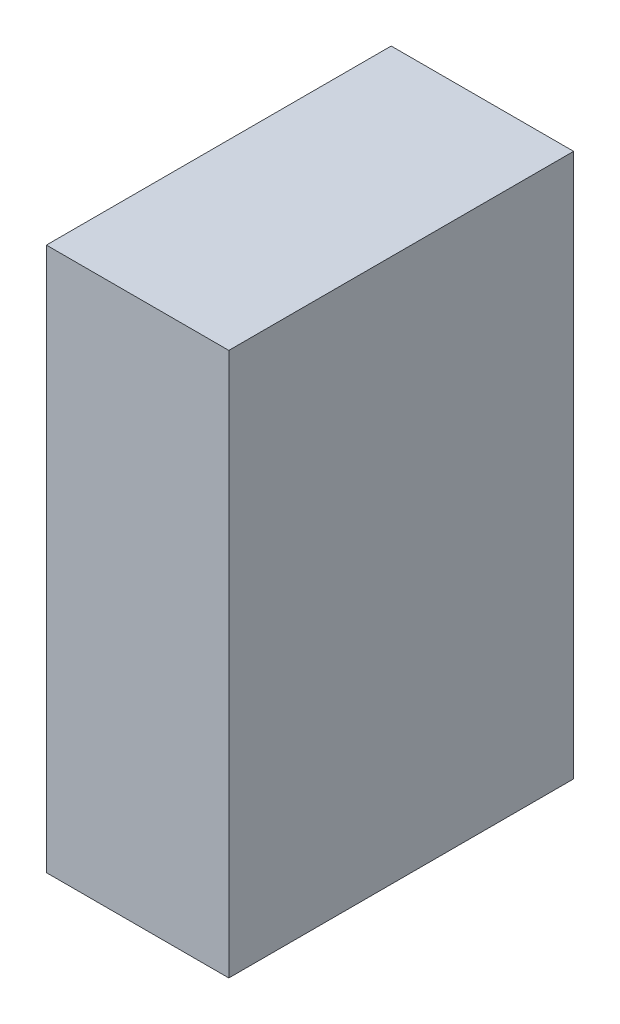
ISO-10303-21;
HEADER;
FILE_DESCRIPTION(('STEP AP214'),'2;1');
FILE_NAME('part.step','',(''),(''),'','','');
FILE_SCHEMA(('AUTOMOTIVE_DESIGN { 1 0 10303 214 1 1 1 1 }'));
ENDSEC;
DATA;
#1=APPLICATION_CONTEXT('core data for automotive mechanical design processes');
#2=APPLICATION_PROTOCOL_DEFINITION('international standard','automotive_design',2000,#1);
#3=PRODUCT_CONTEXT('',#1,'mechanical');
#4=PRODUCT('Part','Part','',(#3));
#5=PRODUCT_RELATED_PRODUCT_CATEGORY('part','',(#4));
#6=PRODUCT_DEFINITION_FORMATION('','',#4);
#7=PRODUCT_DEFINITION_CONTEXT('part definition',#1,'design');
#8=PRODUCT_DEFINITION('design','',#6,#7);
#9=PRODUCT_DEFINITION_SHAPE('','',#8);
#10=(LENGTH_UNIT() NAMED_UNIT(*) SI_UNIT(.MILLI.,.METRE.));
#11=(NAMED_UNIT(*) PLANE_ANGLE_UNIT() SI_UNIT($,.RADIAN.));
#12=(NAMED_UNIT(*) SI_UNIT($,.STERADIAN.) SOLID_ANGLE_UNIT());
#13=UNCERTAINTY_MEASURE_WITH_UNIT(LENGTH_MEASURE(1.E-05),#10,'distance_accuracy_value','');
#14=(GEOMETRIC_REPRESENTATION_CONTEXT(3) GLOBAL_UNCERTAINTY_ASSIGNED_CONTEXT((#13)) GLOBAL_UNIT_ASSIGNED_CONTEXT((#10,
#11,#12)) REPRESENTATION_CONTEXT('',''));
#15=CARTESIAN_POINT('',(0.,0.,0.));
#16=DIRECTION('',(0.,0.,1.));
#17=DIRECTION('',(1.,0.,0.));
#18=AXIS2_PLACEMENT_3D('',#15,#16,#17);
#19=CARTESIAN_POINT('',(0.,86.7,0.));
#20=DIRECTION('',(1.,0.,0.));
#21=DIRECTION('',(0.,0.,-1.));
#22=AXIS2_PLACEMENT_3D('',#19,#20,#21);
#23=PLANE('',#22);
#24=DIRECTION('',(0.,0.,1.));
#25=VECTOR('',#24,1.);
#26=CARTESIAN_POINT('',(0.,0.,0.));
#27=LINE('',#26,#25);
#28=CARTESIAN_POINT('',(0.,0.,-55.));
#29=VERTEX_POINT('',#28);
#30=CARTESIAN_POINT('',(0.,0.,0.));
#31=VERTEX_POINT('',#30);
#32=EDGE_CURVE('E113',#29,#31,#27,.T.);
#33=ORIENTED_EDGE('',*,*,#32,.T.);
#34=DIRECTION('',(0.,-1.,0.));
#35=VECTOR('',#34,1.);
#36=CARTESIAN_POINT('',(0.,86.7,0.));
#37=LINE('',#36,#35);
#38=CARTESIAN_POINT('',(0.,86.7,0.));
#39=VERTEX_POINT('',#38);
#40=EDGE_CURVE('E11',#39,#31,#37,.T.);
#41=ORIENTED_EDGE('',*,*,#40,.F.);
#42=DIRECTION('',(0.,0.,1.));
#43=VECTOR('',#42,1.);
#44=CARTESIAN_POINT('',(0.,86.7,0.));
#45=LINE('',#44,#43);
#46=CARTESIAN_POINT('',(0.,86.7,-55.));
#47=VERTEX_POINT('',#46);
#48=EDGE_CURVE('E97',#47,#39,#45,.T.);
#49=ORIENTED_EDGE('',*,*,#48,.F.);
#50=DIRECTION('',(0.,-1.,0.));
#51=VECTOR('',#50,1.);
#52=CARTESIAN_POINT('',(0.,86.7,-55.));
#53=LINE('',#52,#51);
#54=EDGE_CURVE('E109',#47,#29,#53,.T.);
#55=ORIENTED_EDGE('',*,*,#54,.T.);
#56=EDGE_LOOP('',(#33,#41,#49,#55));
#57=FACE_BOUND('',#56,.T.);
#58=ADVANCED_FACE('F45',(#57),#23,.F.);
#59=CARTESIAN_POINT('',(0.,86.7,0.));
#60=DIRECTION('',(0.,0.,-1.));
#61=DIRECTION('',(-1.,0.,0.));
#62=AXIS2_PLACEMENT_3D('',#59,#60,#61);
#63=PLANE('',#62);
#64=DIRECTION('',(1.,0.,0.));
#65=VECTOR('',#64,1.);
#66=CARTESIAN_POINT('',(0.,0.,0.));
#67=LINE('',#66,#65);
#68=CARTESIAN_POINT('',(29.1,0.,0.));
#69=VERTEX_POINT('',#68);
#70=EDGE_CURVE('E102',#31,#69,#67,.T.);
#71=ORIENTED_EDGE('',*,*,#70,.T.);
#72=DIRECTION('',(0.,-1.,0.));
#73=VECTOR('',#72,1.);
#74=CARTESIAN_POINT('',(29.1,86.7,0.));
#75=LINE('',#74,#73);
#76=CARTESIAN_POINT('',(29.1,86.7,0.));
#77=VERTEX_POINT('',#76);
#78=EDGE_CURVE('E54',#77,#69,#75,.T.);
#79=ORIENTED_EDGE('',*,*,#78,.F.);
#80=DIRECTION('',(1.,0.,0.));
#81=VECTOR('',#80,1.);
#82=CARTESIAN_POINT('',(0.,86.7,0.));
#83=LINE('',#82,#81);
#84=EDGE_CURVE('E92',#39,#77,#83,.T.);
#85=ORIENTED_EDGE('',*,*,#84,.F.);
#86=ORIENTED_EDGE('',*,*,#40,.T.);
#87=EDGE_LOOP('',(#71,#79,#85,#86));
#88=FACE_BOUND('',#87,.T.);
#89=ADVANCED_FACE('F101',(#88),#63,.F.);
#90=CARTESIAN_POINT('',(29.1,86.7,0.));
#91=DIRECTION('',(-1.,0.,0.));
#92=DIRECTION('',(0.,0.,1.));
#93=AXIS2_PLACEMENT_3D('',#90,#91,#92);
#94=PLANE('',#93);
#95=DIRECTION('',(0.,0.,-1.));
#96=VECTOR('',#95,1.);
#97=CARTESIAN_POINT('',(29.1,0.,0.));
#98=LINE('',#97,#96);
#99=CARTESIAN_POINT('',(29.1,0.,-55.));
#100=VERTEX_POINT('',#99);
#101=EDGE_CURVE('E79',#69,#100,#98,.T.);
#102=ORIENTED_EDGE('',*,*,#101,.T.);
#103=DIRECTION('',(0.,-1.,0.));
#104=VECTOR('',#103,1.);
#105=CARTESIAN_POINT('',(29.1,86.7,-55.));
#106=LINE('',#105,#104);
#107=CARTESIAN_POINT('',(29.1,86.7,-55.));
#108=VERTEX_POINT('',#107);
#109=EDGE_CURVE('E104',#108,#100,#106,.T.);
#110=ORIENTED_EDGE('',*,*,#109,.F.);
#111=DIRECTION('',(0.,0.,-1.));
#112=VECTOR('',#111,1.);
#113=CARTESIAN_POINT('',(29.1,86.7,0.));
#114=LINE('',#113,#112);
#115=EDGE_CURVE('E95',#77,#108,#114,.T.);
#116=ORIENTED_EDGE('',*,*,#115,.F.);
#117=ORIENTED_EDGE('',*,*,#78,.T.);
#118=EDGE_LOOP('',(#102,#110,#116,#117));
#119=FACE_BOUND('',#118,.T.);
#120=ADVANCED_FACE('F105',(#119),#94,.F.);
#121=CARTESIAN_POINT('',(0.,86.7,-55.));
#122=DIRECTION('',(0.,0.,1.));
#123=DIRECTION('',(1.,0.,0.));
#124=AXIS2_PLACEMENT_3D('',#121,#122,#123);
#125=PLANE('',#124);
#126=DIRECTION('',(-1.,0.,0.));
#127=VECTOR('',#126,1.);
#128=CARTESIAN_POINT('',(0.,0.,-55.));
#129=LINE('',#128,#127);
#130=EDGE_CURVE('E85',#100,#29,#129,.T.);
#131=ORIENTED_EDGE('',*,*,#130,.T.);
#132=ORIENTED_EDGE('',*,*,#54,.F.);
#133=DIRECTION('',(-1.,0.,0.));
#134=VECTOR('',#133,1.);
#135=CARTESIAN_POINT('',(0.,86.7,-55.));
#136=LINE('',#135,#134);
#137=EDGE_CURVE('E62',#108,#47,#136,.T.);
#138=ORIENTED_EDGE('',*,*,#137,.F.);
#139=ORIENTED_EDGE('',*,*,#109,.T.);
#140=EDGE_LOOP('',(#131,#132,#138,#139));
#141=FACE_BOUND('',#140,.T.);
#142=ADVANCED_FACE('F126',(#141),#125,.F.);
#143=CARTESIAN_POINT('',(0.,86.7,0.));
#144=DIRECTION('',(0.,-1.,0.));
#145=DIRECTION('',(0.,0.,-1.));
#146=AXIS2_PLACEMENT_3D('',#143,#144,#145);
#147=PLANE('',#146);
#148=ORIENTED_EDGE('',*,*,#48,.T.);
#149=ORIENTED_EDGE('',*,*,#84,.T.);
#150=ORIENTED_EDGE('',*,*,#115,.T.);
#151=ORIENTED_EDGE('',*,*,#137,.T.);
#152=EDGE_LOOP('',(#148,#149,#150,#151));
#153=FACE_BOUND('',#152,.T.);
#154=ADVANCED_FACE('F93',(#153),#147,.F.);
#155=CARTESIAN_POINT('',(0.,0.,0.));
#156=DIRECTION('',(0.,-1.,0.));
#157=DIRECTION('',(0.,0.,-1.));
#158=AXIS2_PLACEMENT_3D('',#155,#156,#157);
#159=PLANE('',#158);
#160=ORIENTED_EDGE('',*,*,#32,.F.);
#161=ORIENTED_EDGE('',*,*,#130,.F.);
#162=ORIENTED_EDGE('',*,*,#101,.F.);
#163=ORIENTED_EDGE('',*,*,#70,.F.);
#164=EDGE_LOOP('',(#160,#161,#162,#163));
#165=FACE_BOUND('',#164,.T.);
#166=ADVANCED_FACE('F129',(#165),#159,.T.);
#167=CLOSED_SHELL('',(#58,#89,#120,#142,#154,#166));
#168=MANIFOLD_SOLID_BREP('B2',#167);
#169=ADVANCED_BREP_SHAPE_REPRESENTATION('',(#18,#168),#14);
#170=SHAPE_DEFINITION_REPRESENTATION(#9,#169);
ENDSEC;
END-ISO-10303-21;
